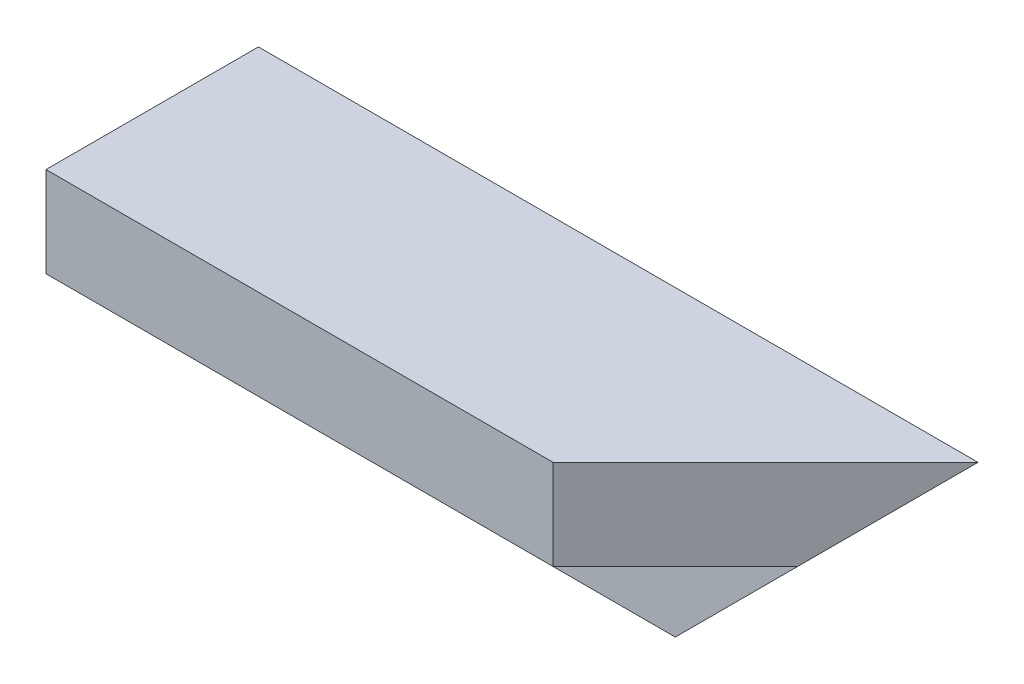
ISO-10303-21;
HEADER;
FILE_DESCRIPTION(('STEP AP214'),'2;1');
FILE_NAME('part.step','',(''),(''),'','','');
FILE_SCHEMA(('AUTOMOTIVE_DESIGN { 1 0 10303 214 1 1 1 1 }'));
ENDSEC;
DATA;
#1=APPLICATION_CONTEXT('core data for automotive mechanical design processes');
#2=APPLICATION_PROTOCOL_DEFINITION('international standard','automotive_design',2000,#1);
#3=PRODUCT_CONTEXT('',#1,'mechanical');
#4=PRODUCT('Part','Part','',(#3));
#5=PRODUCT_RELATED_PRODUCT_CATEGORY('part','',(#4));
#6=PRODUCT_DEFINITION_FORMATION('','',#4);
#7=PRODUCT_DEFINITION_CONTEXT('part definition',#1,'design');
#8=PRODUCT_DEFINITION('design','',#6,#7);
#9=PRODUCT_DEFINITION_SHAPE('','',#8);
#10=(LENGTH_UNIT() NAMED_UNIT(*) SI_UNIT(.MILLI.,.METRE.));
#11=(NAMED_UNIT(*) PLANE_ANGLE_UNIT() SI_UNIT($,.RADIAN.));
#12=(NAMED_UNIT(*) SI_UNIT($,.STERADIAN.) SOLID_ANGLE_UNIT());
#13=UNCERTAINTY_MEASURE_WITH_UNIT(LENGTH_MEASURE(1.E-05),#10,'distance_accuracy_value','');
#14=(GEOMETRIC_REPRESENTATION_CONTEXT(3) GLOBAL_UNCERTAINTY_ASSIGNED_CONTEXT((#13)) GLOBAL_UNIT_ASSIGNED_CONTEXT((#10,
#11,#12)) REPRESENTATION_CONTEXT('',''));
#15=CARTESIAN_POINT('',(0.,0.,0.));
#16=DIRECTION('',(0.,0.,1.));
#17=DIRECTION('',(1.,0.,0.));
#18=AXIS2_PLACEMENT_3D('',#15,#16,#17);
#19=CARTESIAN_POINT('',(222.,-40.,0.));
#20=DIRECTION('',(0.,0.,1.));
#21=DIRECTION('',(1.,0.,0.));
#22=AXIS2_PLACEMENT_3D('',#19,#20,#21);
#23=PLANE('',#22);
#24=DIRECTION('',(-1.,0.,0.));
#25=VECTOR('',#24,1.);
#26=CARTESIAN_POINT('',(222.,0.,0.));
#27=LINE('',#26,#25);
#28=CARTESIAN_POINT('',(222.,0.,0.));
#29=VERTEX_POINT('',#28);
#30=CARTESIAN_POINT('',(86.4999999999805,0.,0.));
#31=VERTEX_POINT('',#30);
#32=EDGE_CURVE('E40',#29,#31,#27,.T.);
#33=ORIENTED_EDGE('',*,*,#32,.F.);
#34=DIRECTION('',(0.707106781186548,0.707106781186547,0.));
#35=VECTOR('',#34,1.);
#36=CARTESIAN_POINT('',(222.,0.,0.));
#37=LINE('',#36,#35);
#38=CARTESIAN_POINT('',(182.,-40.,0.));
#39=VERTEX_POINT('',#38);
#40=EDGE_CURVE('E88',#39,#29,#37,.T.);
#41=ORIENTED_EDGE('',*,*,#40,.F.);
#42=DIRECTION('',(-1.,0.,0.));
#43=VECTOR('',#42,1.);
#44=CARTESIAN_POINT('',(222.,-40.,0.));
#45=LINE('',#44,#43);
#46=CARTESIAN_POINT('',(86.4999999999805,-40.,0.));
#47=VERTEX_POINT('',#46);
#48=EDGE_CURVE('E47',#39,#47,#45,.T.);
#49=ORIENTED_EDGE('',*,*,#48,.T.);
#50=DIRECTION('',(0.,1.,0.));
#51=VECTOR('',#50,1.);
#52=CARTESIAN_POINT('',(86.4999999999805,-40.,0.));
#53=LINE('',#52,#51);
#54=EDGE_CURVE('E118',#47,#31,#53,.T.);
#55=ORIENTED_EDGE('',*,*,#54,.T.);
#56=EDGE_LOOP('',(#33,#41,#49,#55));
#57=FACE_BOUND('',#56,.T.);
#58=ADVANCED_FACE('F33',(#57),#23,.F.);
#59=CARTESIAN_POINT('',(222.,0.,0.));
#60=DIRECTION('',(0.,-1.,0.));
#61=DIRECTION('',(0.,0.,-1.));
#62=AXIS2_PLACEMENT_3D('',#59,#60,#61);
#63=PLANE('',#62);
#64=DIRECTION('',(-1.,0.,0.));
#65=VECTOR('',#64,1.);
#66=CARTESIAN_POINT('',(222.,0.,40.));
#67=LINE('',#66,#65);
#68=CARTESIAN_POINT('',(182.,0.,40.));
#69=VERTEX_POINT('',#68);
#70=CARTESIAN_POINT('',(86.4999999999805,0.,40.));
#71=VERTEX_POINT('',#70);
#72=EDGE_CURVE('E109',#69,#71,#67,.T.);
#73=ORIENTED_EDGE('',*,*,#72,.F.);
#74=DIRECTION('',(-0.707106781186548,0.,0.707106781186547));
#75=VECTOR('',#74,1.);
#76=CARTESIAN_POINT('',(222.,0.,0.));
#77=LINE('',#76,#75);
#78=EDGE_CURVE('E117',#29,#69,#77,.T.);
#79=ORIENTED_EDGE('',*,*,#78,.F.);
#80=ORIENTED_EDGE('',*,*,#32,.T.);
#81=DIRECTION('',(0.,0.,1.));
#82=VECTOR('',#81,1.);
#83=CARTESIAN_POINT('',(86.4999999999805,0.,0.));
#84=LINE('',#83,#82);
#85=EDGE_CURVE('E115',#31,#71,#84,.T.);
#86=ORIENTED_EDGE('',*,*,#85,.T.);
#87=EDGE_LOOP('',(#73,#79,#80,#86));
#88=FACE_BOUND('',#87,.T.);
#89=ADVANCED_FACE('F114',(#88),#63,.F.);
#90=CARTESIAN_POINT('',(222.,0.,40.));
#91=DIRECTION('',(0.,0.,-1.));
#92=DIRECTION('',(-1.,0.,0.));
#93=AXIS2_PLACEMENT_3D('',#90,#91,#92);
#94=PLANE('',#93);
#95=DIRECTION('',(-1.,0.,0.));
#96=VECTOR('',#95,1.);
#97=CARTESIAN_POINT('',(222.,-17.,40.));
#98=LINE('',#97,#96);
#99=CARTESIAN_POINT('',(182.,-17.,40.));
#100=VERTEX_POINT('',#99);
#101=CARTESIAN_POINT('',(86.4999999999805,-17.,40.));
#102=VERTEX_POINT('',#101);
#103=EDGE_CURVE('E107',#100,#102,#98,.T.);
#104=ORIENTED_EDGE('',*,*,#103,.F.);
#105=DIRECTION('',(0.,1.,0.));
#106=VECTOR('',#105,1.);
#107=CARTESIAN_POINT('',(182.,-40.,40.));
#108=LINE('',#107,#106);
#109=EDGE_CURVE('E125',#100,#69,#108,.T.);
#110=ORIENTED_EDGE('',*,*,#109,.T.);
#111=ORIENTED_EDGE('',*,*,#72,.T.);
#112=DIRECTION('',(0.,-1.,0.));
#113=VECTOR('',#112,1.);
#114=CARTESIAN_POINT('',(86.4999999999805,0.,40.));
#115=LINE('',#114,#113);
#116=EDGE_CURVE('E122',#71,#102,#115,.T.);
#117=ORIENTED_EDGE('',*,*,#116,.T.);
#118=EDGE_LOOP('',(#104,#110,#111,#117));
#119=FACE_BOUND('',#118,.T.);
#120=ADVANCED_FACE('F153',(#119),#94,.F.);
#121=CARTESIAN_POINT('',(222.,-17.,40.));
#122=DIRECTION('',(0.,1.,0.));
#123=DIRECTION('',(0.,0.,1.));
#124=AXIS2_PLACEMENT_3D('',#121,#122,#123);
#125=PLANE('',#124);
#126=DIRECTION('',(-1.,0.,0.));
#127=VECTOR('',#126,1.);
#128=CARTESIAN_POINT('',(222.,-17.,17.));
#129=LINE('',#128,#127);
#130=CARTESIAN_POINT('',(205.,-17.,17.));
#131=VERTEX_POINT('',#130);
#132=CARTESIAN_POINT('',(86.4999999999805,-17.,17.));
#133=VERTEX_POINT('',#132);
#134=EDGE_CURVE('E100',#131,#133,#129,.T.);
#135=ORIENTED_EDGE('',*,*,#134,.F.);
#136=DIRECTION('',(-0.707106781186548,0.,0.707106781186548));
#137=VECTOR('',#136,1.);
#138=CARTESIAN_POINT('',(202.,-17.,20.));
#139=LINE('',#138,#137);
#140=EDGE_CURVE('E120',#131,#100,#139,.T.);
#141=ORIENTED_EDGE('',*,*,#140,.T.);
#142=ORIENTED_EDGE('',*,*,#103,.T.);
#143=DIRECTION('',(0.,0.,-1.));
#144=VECTOR('',#143,1.);
#145=CARTESIAN_POINT('',(86.4999999999805,-17.,40.));
#146=LINE('',#145,#144);
#147=EDGE_CURVE('E131',#102,#133,#146,.T.);
#148=ORIENTED_EDGE('',*,*,#147,.T.);
#149=EDGE_LOOP('',(#135,#141,#142,#148));
#150=FACE_BOUND('',#149,.T.);
#151=ADVANCED_FACE('F157',(#150),#125,.F.);
#152=CARTESIAN_POINT('',(222.,-17.,17.));
#153=DIRECTION('',(0.,0.,-1.));
#154=DIRECTION('',(0.,1.,0.));
#155=AXIS2_PLACEMENT_3D('',#152,#153,#154);
#156=PLANE('',#155);
#157=DIRECTION('',(-1.,0.,0.));
#158=VECTOR('',#157,1.);
#159=CARTESIAN_POINT('',(222.,-40.,17.));
#160=LINE('',#159,#158);
#161=CARTESIAN_POINT('',(182.,-40.,17.));
#162=VERTEX_POINT('',#161);
#163=CARTESIAN_POINT('',(86.4999999999805,-40.,17.));
#164=VERTEX_POINT('',#163);
#165=EDGE_CURVE('E54',#162,#164,#160,.T.);
#166=ORIENTED_EDGE('',*,*,#165,.F.);
#167=DIRECTION('',(0.707106781186548,0.707106781186547,0.));
#168=VECTOR('',#167,1.);
#169=CARTESIAN_POINT('',(213.5,-8.50000000000003,17.));
#170=LINE('',#169,#168);
#171=EDGE_CURVE('E90',#162,#131,#170,.T.);
#172=ORIENTED_EDGE('',*,*,#171,.T.);
#173=ORIENTED_EDGE('',*,*,#134,.T.);
#174=DIRECTION('',(0.,-1.,0.));
#175=VECTOR('',#174,1.);
#176=CARTESIAN_POINT('',(86.4999999999805,-17.,17.));
#177=LINE('',#176,#175);
#178=EDGE_CURVE('E102',#133,#164,#177,.T.);
#179=ORIENTED_EDGE('',*,*,#178,.T.);
#180=EDGE_LOOP('',(#166,#172,#173,#179));
#181=FACE_BOUND('',#180,.T.);
#182=ADVANCED_FACE('F135',(#181),#156,.F.);
#183=CARTESIAN_POINT('',(222.,-40.,17.));
#184=DIRECTION('',(0.,1.,0.));
#185=DIRECTION('',(0.,0.,1.));
#186=AXIS2_PLACEMENT_3D('',#183,#184,#185);
#187=PLANE('',#186);
#188=ORIENTED_EDGE('',*,*,#48,.F.);
#189=DIRECTION('',(0.,0.,-1.));
#190=VECTOR('',#189,1.);
#191=CARTESIAN_POINT('',(182.,-40.,40.));
#192=LINE('',#191,#190);
#193=EDGE_CURVE('E86',#162,#39,#192,.T.);
#194=ORIENTED_EDGE('',*,*,#193,.F.);
#195=ORIENTED_EDGE('',*,*,#165,.T.);
#196=DIRECTION('',(0.,0.,-1.));
#197=VECTOR('',#196,1.);
#198=CARTESIAN_POINT('',(86.4999999999805,-40.,17.));
#199=LINE('',#198,#197);
#200=EDGE_CURVE('E97',#164,#47,#199,.T.);
#201=ORIENTED_EDGE('',*,*,#200,.T.);
#202=EDGE_LOOP('',(#188,#194,#195,#201));
#203=FACE_BOUND('',#202,.T.);
#204=ADVANCED_FACE('F95',(#203),#187,.F.);
#205=CARTESIAN_POINT('',(86.4999999999805,0.,0.));
#206=DIRECTION('',(1.,0.,0.));
#207=DIRECTION('',(0.,0.,-1.));
#208=AXIS2_PLACEMENT_3D('',#205,#206,#207);
#209=PLANE('',#208);
#210=ORIENTED_EDGE('',*,*,#54,.F.);
#211=ORIENTED_EDGE('',*,*,#200,.F.);
#212=ORIENTED_EDGE('',*,*,#178,.F.);
#213=ORIENTED_EDGE('',*,*,#147,.F.);
#214=ORIENTED_EDGE('',*,*,#116,.F.);
#215=ORIENTED_EDGE('',*,*,#85,.F.);
#216=EDGE_LOOP('',(#210,#211,#212,#213,#214,#215));
#217=FACE_BOUND('',#216,.T.);
#218=ADVANCED_FACE('F138',(#217),#209,.F.);
#219=CARTESIAN_POINT('',(222.,-40.,0.));
#220=DIRECTION('',(-0.707106781186548,0.,-0.707106781186548));
#221=DIRECTION('',(-0.707106781186548,0.,0.707106781186548));
#222=AXIS2_PLACEMENT_3D('',#219,#220,#221);
#223=PLANE('',#222);
#224=ORIENTED_EDGE('',*,*,#140,.F.);
#225=DIRECTION('',(0.577350269189626,0.577350269189626,-0.577350269189626));
#226=VECTOR('',#225,1.);
#227=CARTESIAN_POINT('',(208.666666666667,-13.3333333333333,13.3333333333333));
#228=LINE('',#227,#226);
#229=EDGE_CURVE('E11',#131,#29,#228,.T.);
#230=ORIENTED_EDGE('',*,*,#229,.T.);
#231=ORIENTED_EDGE('',*,*,#78,.T.);
#232=ORIENTED_EDGE('',*,*,#109,.F.);
#233=EDGE_LOOP('',(#224,#230,#231,#232));
#234=FACE_BOUND('',#233,.T.);
#235=ADVANCED_FACE('F140',(#234),#223,.F.);
#236=CARTESIAN_POINT('',(222.,0.,40.));
#237=DIRECTION('',(-0.707106781186547,0.707106781186548,0.));
#238=DIRECTION('',(-0.707106781186548,-0.707106781186547,0.));
#239=AXIS2_PLACEMENT_3D('',#236,#237,#238);
#240=PLANE('',#239);
#241=ORIENTED_EDGE('',*,*,#193,.T.);
#242=ORIENTED_EDGE('',*,*,#40,.T.);
#243=ORIENTED_EDGE('',*,*,#229,.F.);
#244=ORIENTED_EDGE('',*,*,#171,.F.);
#245=EDGE_LOOP('',(#241,#242,#243,#244));
#246=FACE_BOUND('',#245,.T.);
#247=ADVANCED_FACE('F87',(#246),#240,.F.);
#248=CLOSED_SHELL('',(#58,#89,#120,#151,#182,#204,#218,#235,#247));
#249=MANIFOLD_SOLID_BREP('B2',#248);
#250=ADVANCED_BREP_SHAPE_REPRESENTATION('',(#18,#249),#14);
#251=SHAPE_DEFINITION_REPRESENTATION(#9,#250);
ENDSEC;
END-ISO-10303-21;
